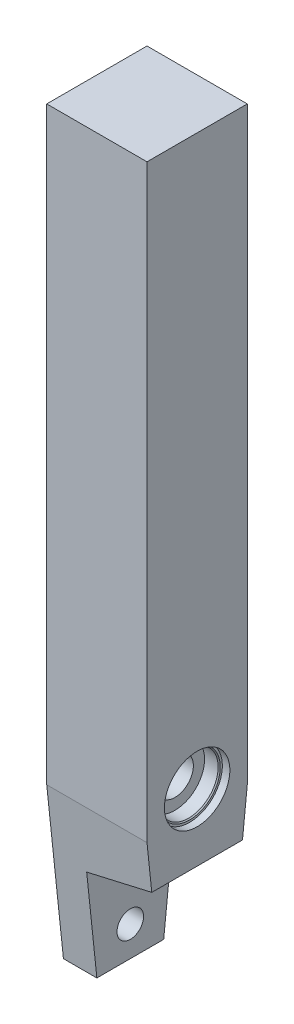
ISO-10303-21;
HEADER;
FILE_DESCRIPTION(('STEP AP214'),'2;1');
FILE_NAME('part.step','',(''),(''),'','','');
FILE_SCHEMA(('AUTOMOTIVE_DESIGN { 1 0 10303 214 1 1 1 1 }'));
ENDSEC;
DATA;
#1=APPLICATION_CONTEXT('core data for automotive mechanical design processes');
#2=APPLICATION_PROTOCOL_DEFINITION('international standard','automotive_design',2000,#1);
#3=PRODUCT_CONTEXT('',#1,'mechanical');
#4=PRODUCT('Part','Part','',(#3));
#5=PRODUCT_RELATED_PRODUCT_CATEGORY('part','',(#4));
#6=PRODUCT_DEFINITION_FORMATION('','',#4);
#7=PRODUCT_DEFINITION_CONTEXT('part definition',#1,'design');
#8=PRODUCT_DEFINITION('design','',#6,#7);
#9=PRODUCT_DEFINITION_SHAPE('','',#8);
#10=(LENGTH_UNIT() NAMED_UNIT(*) SI_UNIT(.MILLI.,.METRE.));
#11=(NAMED_UNIT(*) PLANE_ANGLE_UNIT() SI_UNIT($,.RADIAN.));
#12=(NAMED_UNIT(*) SI_UNIT($,.STERADIAN.) SOLID_ANGLE_UNIT());
#13=UNCERTAINTY_MEASURE_WITH_UNIT(LENGTH_MEASURE(1.E-05),#10,'distance_accuracy_value','');
#14=(GEOMETRIC_REPRESENTATION_CONTEXT(3) GLOBAL_UNCERTAINTY_ASSIGNED_CONTEXT((#13)) GLOBAL_UNIT_ASSIGNED_CONTEXT((#10,
#11,#12)) REPRESENTATION_CONTEXT('',''));
#15=CARTESIAN_POINT('',(0.,0.,0.));
#16=DIRECTION('',(0.,0.,1.));
#17=DIRECTION('',(1.,0.,0.));
#18=AXIS2_PLACEMENT_3D('',#15,#16,#17);
#19=CARTESIAN_POINT('',(0.,0.,19.05));
#20=DIRECTION('',(0.,0.,-1.));
#21=DIRECTION('',(-1.,0.,0.));
#22=AXIS2_PLACEMENT_3D('',#19,#20,#21);
#23=PLANE('',#22);
#24=DIRECTION('',(-1.,0.,0.));
#25=VECTOR('',#24,1.);
#26=CARTESIAN_POINT('',(387.031037476241,-8.12568571568249,19.05));
#27=LINE('',#26,#25);
#28=CARTESIAN_POINT('',(19.05,-8.12568571568249,19.05));
#29=VERTEX_POINT('',#28);
#30=CARTESIAN_POINT('',(-19.05,-8.12568571568249,19.05));
#31=VERTEX_POINT('',#30);
#32=EDGE_CURVE('E159',#29,#31,#27,.T.);
#33=ORIENTED_EDGE('',*,*,#32,.F.);
#34=DIRECTION('',(0.,1.,0.));
#35=VECTOR('',#34,1.);
#36=CARTESIAN_POINT('',(19.05,-82.55,19.05));
#37=LINE('',#36,#35);
#38=CARTESIAN_POINT('',(19.05,215.9,19.05));
#39=VERTEX_POINT('',#38);
#40=EDGE_CURVE('E108',#29,#39,#37,.T.);
#41=ORIENTED_EDGE('',*,*,#40,.T.);
#42=DIRECTION('',(-1.,0.,0.));
#43=VECTOR('',#42,1.);
#44=CARTESIAN_POINT('',(-19.05,215.9,19.05));
#45=LINE('',#44,#43);
#46=CARTESIAN_POINT('',(-19.05,215.9,19.05));
#47=VERTEX_POINT('',#46);
#48=EDGE_CURVE('E69',#39,#47,#45,.T.);
#49=ORIENTED_EDGE('',*,*,#48,.T.);
#50=DIRECTION('',(0.,-1.,0.));
#51=VECTOR('',#50,1.);
#52=CARTESIAN_POINT('',(-19.05,-82.55,19.05));
#53=LINE('',#52,#51);
#54=EDGE_CURVE('E102',#47,#31,#53,.T.);
#55=ORIENTED_EDGE('',*,*,#54,.T.);
#56=EDGE_LOOP('',(#33,#41,#49,#55));
#57=FACE_BOUND('',#56,.T.);
#58=ADVANCED_FACE('F45',(#57),#23,.F.);
#59=CARTESIAN_POINT('',(0.,0.,-19.05));
#60=DIRECTION('',(0.,0.,-1.));
#61=DIRECTION('',(-1.,0.,0.));
#62=AXIS2_PLACEMENT_3D('',#59,#60,#61);
#63=PLANE('',#62);
#64=DIRECTION('',(0.,1.,0.));
#65=VECTOR('',#64,1.);
#66=CARTESIAN_POINT('',(19.05,-82.55,-19.05));
#67=LINE('',#66,#65);
#68=CARTESIAN_POINT('',(19.05,-8.12568571568248,-19.05));
#69=VERTEX_POINT('',#68);
#70=CARTESIAN_POINT('',(19.05,215.9,-19.05));
#71=VERTEX_POINT('',#70);
#72=EDGE_CURVE('E93',#69,#71,#67,.T.);
#73=ORIENTED_EDGE('',*,*,#72,.F.);
#74=DIRECTION('',(-1.,0.,0.));
#75=VECTOR('',#74,1.);
#76=CARTESIAN_POINT('',(387.031037476241,-8.12568571568248,-19.05));
#77=LINE('',#76,#75);
#78=CARTESIAN_POINT('',(-19.05,-8.12568571568248,-19.05));
#79=VERTEX_POINT('',#78);
#80=EDGE_CURVE('E107',#69,#79,#77,.T.);
#81=ORIENTED_EDGE('',*,*,#80,.T.);
#82=DIRECTION('',(0.,-1.,0.));
#83=VECTOR('',#82,1.);
#84=CARTESIAN_POINT('',(-19.05,-82.55,-19.05));
#85=LINE('',#84,#83);
#86=CARTESIAN_POINT('',(-19.05,215.9,-19.05));
#87=VERTEX_POINT('',#86);
#88=EDGE_CURVE('E92',#87,#79,#85,.T.);
#89=ORIENTED_EDGE('',*,*,#88,.F.);
#90=DIRECTION('',(-1.,0.,0.));
#91=VECTOR('',#90,1.);
#92=CARTESIAN_POINT('',(-19.05,215.9,-19.05));
#93=LINE('',#92,#91);
#94=EDGE_CURVE('E82',#71,#87,#93,.T.);
#95=ORIENTED_EDGE('',*,*,#94,.F.);
#96=EDGE_LOOP('',(#73,#81,#89,#95));
#97=FACE_BOUND('',#96,.T.);
#98=ADVANCED_FACE('F105',(#97),#63,.T.);
#99=CARTESIAN_POINT('',(19.05,-82.55,19.05));
#100=DIRECTION('',(-1.,0.,0.));
#101=DIRECTION('',(0.,0.,1.));
#102=AXIS2_PLACEMENT_3D('',#99,#100,#101);
#103=PLANE('',#102);
#104=CARTESIAN_POINT('',(19.05,0.,0.));
#105=DIRECTION('',(1.,0.,0.));
#106=DIRECTION('',(0.,0.,1.));
#107=AXIS2_PLACEMENT_3D('',#104,#105,#106);
#108=CIRCLE('',#107,12.430125);
#109=CARTESIAN_POINT('',(19.05,0.,12.430125));
#110=VERTEX_POINT('',#109);
#111=EDGE_CURVE('E126',#110,#110,#108,.T.);
#112=ORIENTED_EDGE('',*,*,#111,.F.);
#113=EDGE_LOOP('',(#112));
#114=FACE_BOUND('',#113,.T.);
#115=ORIENTED_EDGE('',*,*,#40,.F.);
#116=DIRECTION('',(0.,-0.994521895368274,-0.104528463267647));
#117=VECTOR('',#116,1.);
#118=CARTESIAN_POINT('',(19.05,-81.7368250845733,11.3131574895981));
#119=LINE('',#118,#117);
#120=CARTESIAN_POINT('',(19.05,-25.4,17.234396407408));
#121=VERTEX_POINT('',#120);
#122=EDGE_CURVE('E175',#29,#121,#119,.T.);
#123=ORIENTED_EDGE('',*,*,#122,.T.);
#124=DIRECTION('',(0.,0.,-1.));
#125=VECTOR('',#124,1.);
#126=CARTESIAN_POINT('',(19.05,-25.4,402.906037476241));
#127=LINE('',#126,#125);
#128=CARTESIAN_POINT('',(19.05,-25.4,-17.234396407408));
#129=VERTEX_POINT('',#128);
#130=EDGE_CURVE('E127',#121,#129,#127,.T.);
#131=ORIENTED_EDGE('',*,*,#130,.T.);
#132=DIRECTION('',(0.,0.994521895368274,-0.104528463267646));
#133=VECTOR('',#132,1.);
#134=CARTESIAN_POINT('',(19.05,-85.6975427946513,-10.8968692835772));
#135=LINE('',#134,#133);
#136=EDGE_CURVE('E166',#129,#69,#135,.T.);
#137=ORIENTED_EDGE('',*,*,#136,.T.);
#138=ORIENTED_EDGE('',*,*,#72,.T.);
#139=DIRECTION('',(0.,0.,-1.));
#140=VECTOR('',#139,1.);
#141=CARTESIAN_POINT('',(19.05,215.9,19.05));
#142=LINE('',#141,#140);
#143=EDGE_CURVE('E88',#39,#71,#142,.T.);
#144=ORIENTED_EDGE('',*,*,#143,.F.);
#145=EDGE_LOOP('',(#115,#123,#131,#137,#138,#144));
#146=FACE_BOUND('',#145,.T.);
#147=ADVANCED_FACE('F47',(#114,#146),#103,.F.);
#148=CARTESIAN_POINT('',(-19.05,215.9,19.05));
#149=DIRECTION('',(0.,-1.,0.));
#150=DIRECTION('',(1.,0.,0.));
#151=AXIS2_PLACEMENT_3D('',#148,#149,#150);
#152=PLANE('',#151);
#153=ORIENTED_EDGE('',*,*,#94,.T.);
#154=DIRECTION('',(0.,0.,-1.));
#155=VECTOR('',#154,1.);
#156=CARTESIAN_POINT('',(-19.05,215.9,19.05));
#157=LINE('',#156,#155);
#158=EDGE_CURVE('E85',#47,#87,#157,.T.);
#159=ORIENTED_EDGE('',*,*,#158,.F.);
#160=ORIENTED_EDGE('',*,*,#48,.F.);
#161=ORIENTED_EDGE('',*,*,#143,.T.);
#162=EDGE_LOOP('',(#153,#159,#160,#161));
#163=FACE_BOUND('',#162,.T.);
#164=ADVANCED_FACE('F84',(#163),#152,.F.);
#165=CARTESIAN_POINT('',(-19.05,-82.55,19.05));
#166=DIRECTION('',(1.,0.,0.));
#167=DIRECTION('',(0.,0.,-1.));
#168=AXIS2_PLACEMENT_3D('',#165,#166,#167);
#169=PLANE('',#168);
#170=CARTESIAN_POINT('',(-19.05,0.,0.));
#171=DIRECTION('',(1.,0.,0.));
#172=DIRECTION('',(0.,0.,1.));
#173=AXIS2_PLACEMENT_3D('',#170,#171,#172);
#174=CIRCLE('',#173,12.430125);
#175=CARTESIAN_POINT('',(-19.05,0.,12.430125));
#176=VERTEX_POINT('',#175);
#177=EDGE_CURVE('E187',#176,#176,#174,.T.);
#178=ORIENTED_EDGE('',*,*,#177,.T.);
#179=EDGE_LOOP('',(#178));
#180=FACE_BOUND('',#179,.T.);
#181=CARTESIAN_POINT('',(-19.05,-57.15,0.));
#182=DIRECTION('',(1.,0.,0.));
#183=DIRECTION('',(0.,0.,-1.));
#184=AXIS2_PLACEMENT_3D('',#181,#182,#183);
#185=CIRCLE('',#184,5.04189999999999);
#186=CARTESIAN_POINT('',(-19.05,-57.15,-5.04189999999999));
#187=VERTEX_POINT('',#186);
#188=EDGE_CURVE('E122',#187,#187,#185,.T.);
#189=ORIENTED_EDGE('',*,*,#188,.T.);
#190=EDGE_LOOP('',(#189));
#191=FACE_BOUND('',#190,.T.);
#192=DIRECTION('',(0.,0.,1.));
#193=VECTOR('',#192,1.);
#194=CARTESIAN_POINT('',(-19.05,-68.5419,19.05));
#195=LINE('',#194,#193);
#196=CARTESIAN_POINT('',(-19.05,-68.5419,-12.7));
#197=VERTEX_POINT('',#196);
#198=CARTESIAN_POINT('',(-19.05,-68.5419,12.7));
#199=VERTEX_POINT('',#198);
#200=EDGE_CURVE('E171',#197,#199,#195,.T.);
#201=ORIENTED_EDGE('',*,*,#200,.T.);
#202=DIRECTION('',(0.,0.994521895368274,0.104528463267647));
#203=VECTOR('',#202,1.);
#204=CARTESIAN_POINT('',(-19.05,-81.7368250845733,11.3131574895981));
#205=LINE('',#204,#203);
#206=EDGE_CURVE('E158',#199,#31,#205,.T.);
#207=ORIENTED_EDGE('',*,*,#206,.T.);
#208=ORIENTED_EDGE('',*,*,#54,.F.);
#209=ORIENTED_EDGE('',*,*,#158,.T.);
#210=ORIENTED_EDGE('',*,*,#88,.T.);
#211=DIRECTION('',(0.,-0.994521895368274,0.104528463267646));
#212=VECTOR('',#211,1.);
#213=CARTESIAN_POINT('',(-19.05,-85.6975427946513,-10.8968692835772));
#214=LINE('',#213,#212);
#215=EDGE_CURVE('E169',#79,#197,#214,.T.);
#216=ORIENTED_EDGE('',*,*,#215,.T.);
#217=EDGE_LOOP('',(#201,#207,#208,#209,#210,#216));
#218=FACE_BOUND('',#217,.T.);
#219=ADVANCED_FACE('F98',(#180,#191,#218),#169,.F.);
#220=CARTESIAN_POINT('',(19.05,-57.15,0.));
#221=DIRECTION('',(1.,0.,0.));
#222=DIRECTION('',(0.,0.,-1.));
#223=AXIS2_PLACEMENT_3D('',#220,#221,#222);
#224=CYLINDRICAL_SURFACE('',#223,5.04189999999999);
#225=CARTESIAN_POINT('',(-6.35000000000001,-57.15,0.));
#226=DIRECTION('',(-1.,0.,0.));
#227=DIRECTION('',(0.,0.,1.));
#228=AXIS2_PLACEMENT_3D('',#225,#226,#227);
#229=CIRCLE('',#228,5.04189999999999);
#230=CARTESIAN_POINT('',(-6.35000000000001,-57.15,5.04189999999999));
#231=VERTEX_POINT('',#230);
#232=EDGE_CURVE('E123',#231,#231,#229,.F.);
#233=ORIENTED_EDGE('',*,*,#232,.T.);
#234=EDGE_LOOP('',(#233));
#235=FACE_BOUND('',#234,.T.);
#236=ORIENTED_EDGE('',*,*,#188,.F.);
#237=EDGE_LOOP('',(#236));
#238=FACE_BOUND('',#237,.T.);
#239=ADVANCED_FACE('F253',(#235,#238),#224,.F.);
#240=CARTESIAN_POINT('',(10.63625,0.,0.));
#241=DIRECTION('',(1.,0.,0.));
#242=DIRECTION('',(0.,0.,1.));
#243=AXIS2_PLACEMENT_3D('',#240,#241,#242);
#244=PLANE('',#243);
#245=CARTESIAN_POINT('',(10.63625,0.,0.));
#246=DIRECTION('',(1.,0.,0.));
#247=DIRECTION('',(0.,0.,1.));
#248=AXIS2_PLACEMENT_3D('',#245,#246,#247);
#249=CIRCLE('',#248,11.2395);
#250=CARTESIAN_POINT('',(10.63625,0.,11.2395));
#251=VERTEX_POINT('',#250);
#252=EDGE_CURVE('E201',#251,#251,#249,.T.);
#253=ORIENTED_EDGE('',*,*,#252,.T.);
#254=EDGE_LOOP('',(#253));
#255=FACE_BOUND('',#254,.T.);
#256=CARTESIAN_POINT('',(10.63625,0.,0.));
#257=DIRECTION('',(1.,0.,0.));
#258=DIRECTION('',(0.,0.,-1.));
#259=AXIS2_PLACEMENT_3D('',#256,#257,#258);
#260=CIRCLE('',#259,6.98499999999999);
#261=CARTESIAN_POINT('',(10.63625,0.,-6.98499999999999));
#262=VERTEX_POINT('',#261);
#263=EDGE_CURVE('E115',#262,#262,#260,.F.);
#264=ORIENTED_EDGE('',*,*,#263,.T.);
#265=EDGE_LOOP('',(#264));
#266=FACE_BOUND('',#265,.T.);
#267=ADVANCED_FACE('F279',(#255,#266),#244,.T.);
#268=CARTESIAN_POINT('',(19.05,0.,0.));
#269=DIRECTION('',(-1.,0.,0.));
#270=DIRECTION('',(0.,0.,-1.));
#271=AXIS2_PLACEMENT_3D('',#268,#269,#270);
#272=CYLINDRICAL_SURFACE('',#271,11.2395);
#273=CARTESIAN_POINT('',(15.795625,0.,0.));
#274=DIRECTION('',(1.,0.,0.));
#275=DIRECTION('',(0.,0.,1.));
#276=AXIS2_PLACEMENT_3D('',#273,#274,#275);
#277=CIRCLE('',#276,11.2395);
#278=CARTESIAN_POINT('',(15.795625,0.,11.2395));
#279=VERTEX_POINT('',#278);
#280=EDGE_CURVE('E190',#279,#279,#277,.F.);
#281=ORIENTED_EDGE('',*,*,#280,.F.);
#282=EDGE_LOOP('',(#281));
#283=FACE_BOUND('',#282,.T.);
#284=ORIENTED_EDGE('',*,*,#252,.F.);
#285=EDGE_LOOP('',(#284));
#286=FACE_BOUND('',#285,.T.);
#287=ADVANCED_FACE('F269',(#283,#286),#272,.F.);
#288=CARTESIAN_POINT('',(17.4625,0.,0.));
#289=DIRECTION('',(1.,0.,0.));
#290=DIRECTION('',(0.,0.,1.));
#291=AXIS2_PLACEMENT_3D('',#288,#289,#290);
#292=CYLINDRICAL_SURFACE('',#291,12.430125);
#293=CARTESIAN_POINT('',(16.1925,0.,0.));
#294=DIRECTION('',(1.,0.,0.));
#295=DIRECTION('',(0.,0.,1.));
#296=AXIS2_PLACEMENT_3D('',#293,#294,#295);
#297=CIRCLE('',#296,12.430125);
#298=CARTESIAN_POINT('',(16.1925,0.,12.430125));
#299=VERTEX_POINT('',#298);
#300=EDGE_CURVE('E198',#299,#299,#297,.T.);
#301=ORIENTED_EDGE('',*,*,#300,.F.);
#302=EDGE_LOOP('',(#301));
#303=FACE_BOUND('',#302,.T.);
#304=ORIENTED_EDGE('',*,*,#111,.T.);
#305=EDGE_LOOP('',(#304));
#306=FACE_BOUND('',#305,.T.);
#307=ADVANCED_FACE('F266',(#303,#306),#292,.F.);
#308=CARTESIAN_POINT('',(16.1925,0.,0.));
#309=DIRECTION('',(1.,0.,0.));
#310=DIRECTION('',(0.,0.,1.));
#311=AXIS2_PLACEMENT_3D('',#308,#309,#310);
#312=PLANE('',#311);
#313=CARTESIAN_POINT('',(16.1925,0.,0.));
#314=DIRECTION('',(1.,0.,0.));
#315=DIRECTION('',(0.,0.,1.));
#316=AXIS2_PLACEMENT_3D('',#313,#314,#315);
#317=CIRCLE('',#316,11.636375);
#318=CARTESIAN_POINT('',(16.1925,0.,11.636375));
#319=VERTEX_POINT('',#318);
#320=EDGE_CURVE('E206',#319,#319,#317,.T.);
#321=ORIENTED_EDGE('',*,*,#320,.F.);
#322=EDGE_LOOP('',(#321));
#323=FACE_BOUND('',#322,.T.);
#324=ORIENTED_EDGE('',*,*,#300,.T.);
#325=EDGE_LOOP('',(#324));
#326=FACE_BOUND('',#325,.T.);
#327=ADVANCED_FACE('F268',(#323,#326),#312,.T.);
#328=CARTESIAN_POINT('',(16.1925,0.,0.));
#329=DIRECTION('',(1.,0.,0.));
#330=DIRECTION('',(0.,0.,1.));
#331=AXIS2_PLACEMENT_3D('',#328,#329,#330);
#332=CONICAL_SURFACE('',#331,11.636375,0.78539816339745);
#333=ORIENTED_EDGE('',*,*,#280,.T.);
#334=EDGE_LOOP('',(#333));
#335=FACE_BOUND('',#334,.T.);
#336=ORIENTED_EDGE('',*,*,#320,.T.);
#337=EDGE_LOOP('',(#336));
#338=FACE_BOUND('',#337,.T.);
#339=ADVANCED_FACE('F276',(#335,#338),#332,.F.);
#340=CARTESIAN_POINT('',(-10.63625,0.,0.));
#341=DIRECTION('',(-1.,0.,0.));
#342=DIRECTION('',(0.,0.,1.));
#343=AXIS2_PLACEMENT_3D('',#340,#341,#342);
#344=PLANE('',#343);
#345=CARTESIAN_POINT('',(-10.63625,0.,0.));
#346=DIRECTION('',(1.,0.,0.));
#347=DIRECTION('',(0.,0.,1.));
#348=AXIS2_PLACEMENT_3D('',#345,#346,#347);
#349=CIRCLE('',#348,11.2395);
#350=CARTESIAN_POINT('',(-10.63625,0.,11.2395));
#351=VERTEX_POINT('',#350);
#352=EDGE_CURVE('E186',#351,#351,#349,.T.);
#353=ORIENTED_EDGE('',*,*,#352,.F.);
#354=EDGE_LOOP('',(#353));
#355=FACE_BOUND('',#354,.T.);
#356=CARTESIAN_POINT('',(-10.63625,0.,0.));
#357=DIRECTION('',(-1.,0.,0.));
#358=DIRECTION('',(0.,0.,1.));
#359=AXIS2_PLACEMENT_3D('',#356,#357,#358);
#360=CIRCLE('',#359,6.98499999999999);
#361=CARTESIAN_POINT('',(-10.63625,0.,6.98499999999999));
#362=VERTEX_POINT('',#361);
#363=EDGE_CURVE('E118',#362,#362,#360,.F.);
#364=ORIENTED_EDGE('',*,*,#363,.T.);
#365=EDGE_LOOP('',(#364));
#366=FACE_BOUND('',#365,.T.);
#367=ADVANCED_FACE('F289',(#355,#366),#344,.T.);
#368=CARTESIAN_POINT('',(-19.05,0.,0.));
#369=DIRECTION('',(1.,0.,0.));
#370=DIRECTION('',(0.,0.,-1.));
#371=AXIS2_PLACEMENT_3D('',#368,#369,#370);
#372=CYLINDRICAL_SURFACE('',#371,11.2395);
#373=CARTESIAN_POINT('',(-15.795625,0.,0.));
#374=DIRECTION('',(1.,0.,0.));
#375=DIRECTION('',(0.,0.,1.));
#376=AXIS2_PLACEMENT_3D('',#373,#374,#375);
#377=CIRCLE('',#376,11.2395);
#378=CARTESIAN_POINT('',(-15.795625,0.,11.2395));
#379=VERTEX_POINT('',#378);
#380=EDGE_CURVE('E119',#379,#379,#377,.F.);
#381=ORIENTED_EDGE('',*,*,#380,.T.);
#382=EDGE_LOOP('',(#381));
#383=FACE_BOUND('',#382,.T.);
#384=ORIENTED_EDGE('',*,*,#352,.T.);
#385=EDGE_LOOP('',(#384));
#386=FACE_BOUND('',#385,.T.);
#387=ADVANCED_FACE('F294',(#383,#386),#372,.F.);
#388=CARTESIAN_POINT('',(-17.4625,0.,0.));
#389=DIRECTION('',(-1.,0.,0.));
#390=DIRECTION('',(0.,0.,1.));
#391=AXIS2_PLACEMENT_3D('',#388,#389,#390);
#392=CYLINDRICAL_SURFACE('',#391,12.430125);
#393=CARTESIAN_POINT('',(-16.1925,0.,0.));
#394=DIRECTION('',(1.,0.,0.));
#395=DIRECTION('',(0.,0.,1.));
#396=AXIS2_PLACEMENT_3D('',#393,#394,#395);
#397=CIRCLE('',#396,12.430125);
#398=CARTESIAN_POINT('',(-16.1925,0.,12.430125));
#399=VERTEX_POINT('',#398);
#400=EDGE_CURVE('E183',#399,#399,#397,.T.);
#401=ORIENTED_EDGE('',*,*,#400,.T.);
#402=EDGE_LOOP('',(#401));
#403=FACE_BOUND('',#402,.T.);
#404=ORIENTED_EDGE('',*,*,#177,.F.);
#405=EDGE_LOOP('',(#404));
#406=FACE_BOUND('',#405,.T.);
#407=ADVANCED_FACE('F390',(#403,#406),#392,.F.);
#408=CARTESIAN_POINT('',(-16.1925,0.,0.));
#409=DIRECTION('',(-1.,0.,0.));
#410=DIRECTION('',(0.,0.,1.));
#411=AXIS2_PLACEMENT_3D('',#408,#409,#410);
#412=PLANE('',#411);
#413=CARTESIAN_POINT('',(-16.1925,0.,0.));
#414=DIRECTION('',(1.,0.,0.));
#415=DIRECTION('',(0.,0.,1.));
#416=AXIS2_PLACEMENT_3D('',#413,#414,#415);
#417=CIRCLE('',#416,11.636375);
#418=CARTESIAN_POINT('',(-16.1925,0.,11.636375));
#419=VERTEX_POINT('',#418);
#420=EDGE_CURVE('E193',#419,#419,#417,.T.);
#421=ORIENTED_EDGE('',*,*,#420,.T.);
#422=EDGE_LOOP('',(#421));
#423=FACE_BOUND('',#422,.T.);
#424=ORIENTED_EDGE('',*,*,#400,.F.);
#425=EDGE_LOOP('',(#424));
#426=FACE_BOUND('',#425,.T.);
#427=ADVANCED_FACE('F380',(#423,#426),#412,.T.);
#428=CARTESIAN_POINT('',(-16.1925,0.,0.));
#429=DIRECTION('',(-1.,0.,0.));
#430=DIRECTION('',(0.,0.,1.));
#431=AXIS2_PLACEMENT_3D('',#428,#429,#430);
#432=CONICAL_SURFACE('',#431,11.636375,0.78539816339745);
#433=ORIENTED_EDGE('',*,*,#380,.F.);
#434=EDGE_LOOP('',(#433));
#435=FACE_BOUND('',#434,.T.);
#436=ORIENTED_EDGE('',*,*,#420,.F.);
#437=EDGE_LOOP('',(#436));
#438=FACE_BOUND('',#437,.T.);
#439=ADVANCED_FACE('F242',(#435,#438),#432,.F.);
#440=CARTESIAN_POINT('',(19.05,0.,0.));
#441=DIRECTION('',(1.,0.,0.));
#442=DIRECTION('',(0.,0.,-1.));
#443=AXIS2_PLACEMENT_3D('',#440,#441,#442);
#444=CYLINDRICAL_SURFACE('',#443,6.98499999999999);
#445=ORIENTED_EDGE('',*,*,#263,.F.);
#446=EDGE_LOOP('',(#445));
#447=FACE_BOUND('',#446,.T.);
#448=ORIENTED_EDGE('',*,*,#363,.F.);
#449=EDGE_LOOP('',(#448));
#450=FACE_BOUND('',#449,.T.);
#451=ADVANCED_FACE('F234',(#447,#450),#444,.F.);
#452=CARTESIAN_POINT('',(-6.35000000000001,-31.75,402.906037476241));
#453=DIRECTION('',(-0.242535625036333,0.970142500145332,0.));
#454=DIRECTION('',(-0.970142500145332,-0.242535625036333,0.));
#455=AXIS2_PLACEMENT_3D('',#452,#453,#454);
#456=PLANE('',#455);
#457=ORIENTED_EDGE('',*,*,#130,.F.);
#458=DIRECTION('',(-0.969827445816816,-0.242456861454204,-0.0254832430080585));
#459=VECTOR('',#458,1.);
#460=CARTESIAN_POINT('',(3.19811798544121,-29.3629705036397,16.8178714232425));
#461=LINE('',#460,#459);
#462=CARTESIAN_POINT('',(-6.35000000000001,-31.75,16.566984513471));
#463=VERTEX_POINT('',#462);
#464=EDGE_CURVE('E173',#121,#463,#461,.T.);
#465=ORIENTED_EDGE('',*,*,#464,.T.);
#466=DIRECTION('',(0.,0.,-1.));
#467=VECTOR('',#466,1.);
#468=CARTESIAN_POINT('',(-6.35000000000001,-31.75,402.906037476241));
#469=LINE('',#468,#467);
#470=CARTESIAN_POINT('',(-6.35000000000001,-31.75,-16.5669845134709));
#471=VERTEX_POINT('',#470);
#472=EDGE_CURVE('E179',#463,#471,#469,.T.);
#473=ORIENTED_EDGE('',*,*,#472,.T.);
#474=DIRECTION('',(0.969827445816816,0.242456861454204,-0.0254832430080584));
#475=VECTOR('',#474,1.);
#476=CARTESIAN_POINT('',(-16.7170024424202,-34.341750610605,-16.294580547544));
#477=LINE('',#476,#475);
#478=EDGE_CURVE('E60',#471,#129,#477,.T.);
#479=ORIENTED_EDGE('',*,*,#478,.T.);
#480=EDGE_LOOP('',(#457,#465,#473,#479));
#481=FACE_BOUND('',#480,.T.);
#482=ADVANCED_FACE('F232',(#481),#456,.F.);
#483=CARTESIAN_POINT('',(-6.35000000000001,-82.55,402.906037476241));
#484=DIRECTION('',(-1.,0.,0.));
#485=DIRECTION('',(0.,0.,1.));
#486=AXIS2_PLACEMENT_3D('',#483,#484,#485);
#487=PLANE('',#486);
#488=ORIENTED_EDGE('',*,*,#232,.F.);
#489=EDGE_LOOP('',(#488));
#490=FACE_BOUND('',#489,.T.);
#491=ORIENTED_EDGE('',*,*,#472,.F.);
#492=DIRECTION('',(0.,-0.994521895368274,-0.104528463267647));
#493=VECTOR('',#492,1.);
#494=CARTESIAN_POINT('',(-6.35000000000001,-41.8327461934306,15.5072451854327));
#495=LINE('',#494,#493);
#496=CARTESIAN_POINT('',(-6.35000000000002,-68.5419,12.7));
#497=VERTEX_POINT('',#496);
#498=EDGE_CURVE('E11',#463,#497,#495,.T.);
#499=ORIENTED_EDGE('',*,*,#498,.T.);
#500=DIRECTION('',(0.,0.,-1.));
#501=VECTOR('',#500,1.);
#502=CARTESIAN_POINT('',(-6.35000000000001,-68.5419,402.906037476241));
#503=LINE('',#502,#501);
#504=CARTESIAN_POINT('',(-6.35000000000002,-68.5419,-12.7));
#505=VERTEX_POINT('',#504);
#506=EDGE_CURVE('E53',#497,#505,#503,.T.);
#507=ORIENTED_EDGE('',*,*,#506,.T.);
#508=DIRECTION('',(0.,0.994521895368274,-0.104528463267646));
#509=VECTOR('',#508,1.);
#510=CARTESIAN_POINT('',(-6.35000000000001,-125.601621685794,-6.70278158774268));
#511=LINE('',#510,#509);
#512=EDGE_CURVE('E114',#505,#471,#511,.T.);
#513=ORIENTED_EDGE('',*,*,#512,.T.);
#514=EDGE_LOOP('',(#491,#499,#507,#513));
#515=FACE_BOUND('',#514,.T.);
#516=ADVANCED_FACE('F133',(#490,#515),#487,.F.);
#517=CARTESIAN_POINT('',(387.031037476241,-8.12568571568249,19.05));
#518=DIRECTION('',(0.,0.104528463267647,-0.994521895368274));
#519=DIRECTION('',(0.,0.994521895368274,0.104528463267647));
#520=AXIS2_PLACEMENT_3D('',#517,#518,#519);
#521=PLANE('',#520);
#522=ORIENTED_EDGE('',*,*,#206,.F.);
#523=DIRECTION('',(-1.,0.,0.));
#524=VECTOR('',#523,1.);
#525=CARTESIAN_POINT('',(387.031037476241,-68.5419,12.7));
#526=LINE('',#525,#524);
#527=EDGE_CURVE('E146',#497,#199,#526,.T.);
#528=ORIENTED_EDGE('',*,*,#527,.F.);
#529=ORIENTED_EDGE('',*,*,#498,.F.);
#530=ORIENTED_EDGE('',*,*,#464,.F.);
#531=ORIENTED_EDGE('',*,*,#122,.F.);
#532=ORIENTED_EDGE('',*,*,#32,.T.);
#533=EDGE_LOOP('',(#522,#528,#529,#530,#531,#532));
#534=FACE_BOUND('',#533,.T.);
#535=ADVANCED_FACE('F153',(#534),#521,.F.);
#536=CARTESIAN_POINT('',(387.031037476241,-68.5419,12.7));
#537=DIRECTION('',(0.,1.,0.));
#538=DIRECTION('',(0.,0.,1.));
#539=AXIS2_PLACEMENT_3D('',#536,#537,#538);
#540=PLANE('',#539);
#541=ORIENTED_EDGE('',*,*,#200,.F.);
#542=DIRECTION('',(-1.,0.,0.));
#543=VECTOR('',#542,1.);
#544=CARTESIAN_POINT('',(387.031037476241,-68.5419,-12.7));
#545=LINE('',#544,#543);
#546=EDGE_CURVE('E148',#505,#197,#545,.T.);
#547=ORIENTED_EDGE('',*,*,#546,.F.);
#548=ORIENTED_EDGE('',*,*,#506,.F.);
#549=ORIENTED_EDGE('',*,*,#527,.T.);
#550=EDGE_LOOP('',(#541,#547,#548,#549));
#551=FACE_BOUND('',#550,.T.);
#552=ADVANCED_FACE('F144',(#551),#540,.F.);
#553=CARTESIAN_POINT('',(387.031037476241,-68.5419,-12.7));
#554=DIRECTION('',(0.,0.104528463267646,0.994521895368274));
#555=DIRECTION('',(0.,-0.994521895368274,0.104528463267646));
#556=AXIS2_PLACEMENT_3D('',#553,#554,#555);
#557=PLANE('',#556);
#558=ORIENTED_EDGE('',*,*,#215,.F.);
#559=ORIENTED_EDGE('',*,*,#80,.F.);
#560=ORIENTED_EDGE('',*,*,#136,.F.);
#561=ORIENTED_EDGE('',*,*,#478,.F.);
#562=ORIENTED_EDGE('',*,*,#512,.F.);
#563=ORIENTED_EDGE('',*,*,#546,.T.);
#564=EDGE_LOOP('',(#558,#559,#560,#561,#562,#563));
#565=FACE_BOUND('',#564,.T.);
#566=ADVANCED_FACE('F356',(#565),#557,.F.);
#567=CLOSED_SHELL('',(#58,#98,#147,#164,#219,#239,#267,#287,#307,#327,#339,#367,#387,#407,#427,
#439,#451,#482,#516,#535,#552,#566));
#568=MANIFOLD_SOLID_BREP('B2',#567);
#569=ADVANCED_BREP_SHAPE_REPRESENTATION('',(#18,#568),#14);
#570=SHAPE_DEFINITION_REPRESENTATION(#9,#569);
ENDSEC;
END-ISO-10303-21;
